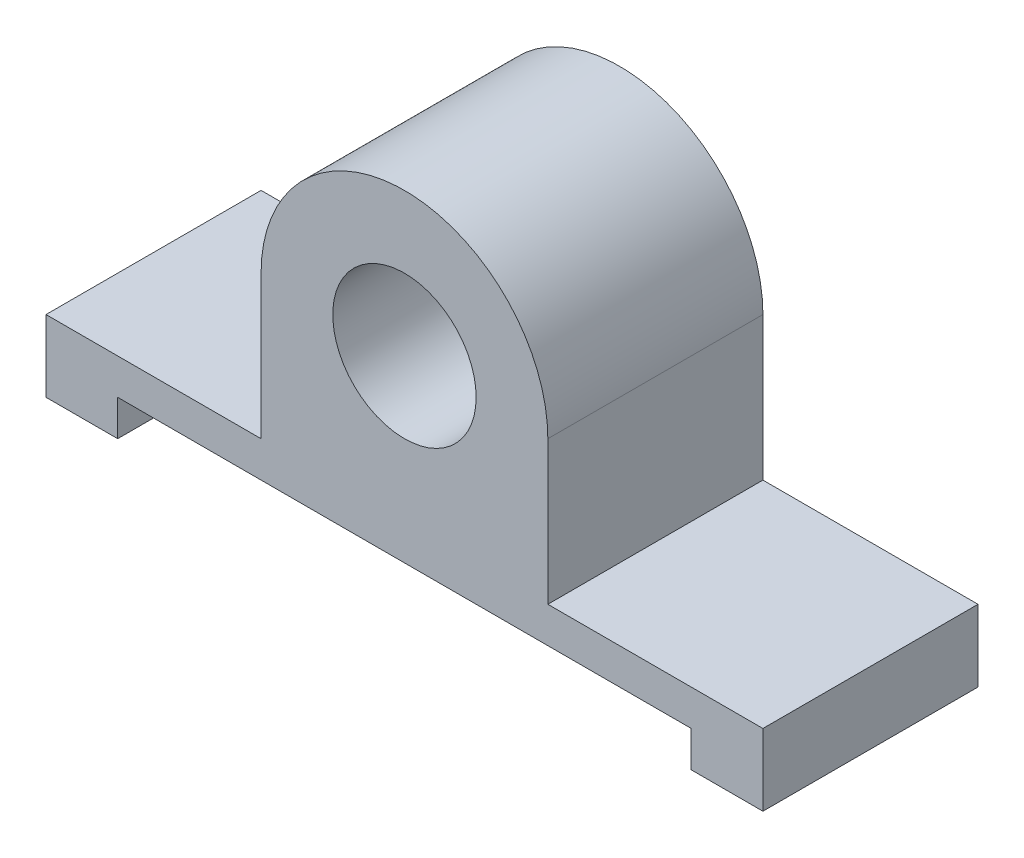
ISO-10303-21;
HEADER;
FILE_DESCRIPTION(('STEP AP214'),'2;1');
FILE_NAME('part.step','',(''),(''),'','','');
FILE_SCHEMA(('AUTOMOTIVE_DESIGN { 1 0 10303 214 1 1 1 1 }'));
ENDSEC;
DATA;
#1=APPLICATION_CONTEXT('core data for automotive mechanical design processes');
#2=APPLICATION_PROTOCOL_DEFINITION('international standard','automotive_design',2000,#1);
#3=PRODUCT_CONTEXT('',#1,'mechanical');
#4=PRODUCT('Part','Part','',(#3));
#5=PRODUCT_RELATED_PRODUCT_CATEGORY('part','',(#4));
#6=PRODUCT_DEFINITION_FORMATION('','',#4);
#7=PRODUCT_DEFINITION_CONTEXT('part definition',#1,'design');
#8=PRODUCT_DEFINITION('design','',#6,#7);
#9=PRODUCT_DEFINITION_SHAPE('','',#8);
#10=(LENGTH_UNIT() NAMED_UNIT(*) SI_UNIT(.MILLI.,.METRE.));
#11=(NAMED_UNIT(*) PLANE_ANGLE_UNIT() SI_UNIT($,.RADIAN.));
#12=(NAMED_UNIT(*) SI_UNIT($,.STERADIAN.) SOLID_ANGLE_UNIT());
#13=UNCERTAINTY_MEASURE_WITH_UNIT(LENGTH_MEASURE(1.E-05),#10,'distance_accuracy_value','');
#14=(GEOMETRIC_REPRESENTATION_CONTEXT(3) GLOBAL_UNCERTAINTY_ASSIGNED_CONTEXT((#13)) GLOBAL_UNIT_ASSIGNED_CONTEXT((#10,
#11,#12)) REPRESENTATION_CONTEXT('',''));
#15=CARTESIAN_POINT('',(0.,0.,0.));
#16=DIRECTION('',(0.,0.,1.));
#17=DIRECTION('',(1.,0.,0.));
#18=AXIS2_PLACEMENT_3D('',#15,#16,#17);
#19=CARTESIAN_POINT('',(1.87479352849255,4.24428591296876,30.));
#20=DIRECTION('',(0.,0.,1.));
#21=DIRECTION('',(1.,0.,0.));
#22=AXIS2_PLACEMENT_3D('',#19,#20,#21);
#23=PLANE('',#22);
#24=DIRECTION('',(0.,-1.,0.));
#25=VECTOR('',#24,1.);
#26=CARTESIAN_POINT('',(41.8747935284925,-20.7557140870312,30.));
#27=LINE('',#26,#25);
#28=CARTESIAN_POINT('',(41.8747935284925,-20.7557140870312,30.));
#29=VERTEX_POINT('',#28);
#30=CARTESIAN_POINT('',(41.8747935284925,-25.7557140870312,30.));
#31=VERTEX_POINT('',#30);
#32=EDGE_CURVE('E177',#29,#31,#27,.T.);
#33=ORIENTED_EDGE('',*,*,#32,.T.);
#34=DIRECTION('',(1.,0.,0.));
#35=VECTOR('',#34,1.);
#36=CARTESIAN_POINT('',(41.8747935284925,-25.7557140870312,30.));
#37=LINE('',#36,#35);
#38=CARTESIAN_POINT('',(51.8747935284926,-25.7557140870312,30.));
#39=VERTEX_POINT('',#38);
#40=EDGE_CURVE('E105',#31,#39,#37,.T.);
#41=ORIENTED_EDGE('',*,*,#40,.T.);
#42=DIRECTION('',(0.,1.,0.));
#43=VECTOR('',#42,1.);
#44=CARTESIAN_POINT('',(51.8747935284926,-25.7557140870312,30.));
#45=LINE('',#44,#43);
#46=CARTESIAN_POINT('',(51.8747935284926,-15.7557140870312,30.));
#47=VERTEX_POINT('',#46);
#48=EDGE_CURVE('E204',#39,#47,#45,.T.);
#49=ORIENTED_EDGE('',*,*,#48,.T.);
#50=DIRECTION('',(-1.,0.,0.));
#51=VECTOR('',#50,1.);
#52=CARTESIAN_POINT('',(51.8747935284926,-15.7557140870312,30.));
#53=LINE('',#52,#51);
#54=CARTESIAN_POINT('',(21.8747935284926,-15.7557140870312,30.));
#55=VERTEX_POINT('',#54);
#56=EDGE_CURVE('E223',#47,#55,#53,.T.);
#57=ORIENTED_EDGE('',*,*,#56,.T.);
#58=DIRECTION('',(0.,1.,0.));
#59=VECTOR('',#58,1.);
#60=CARTESIAN_POINT('',(21.8747935284926,4.24428591296876,30.));
#61=LINE('',#60,#59);
#62=CARTESIAN_POINT('',(21.8747935284926,4.24428591296876,30.));
#63=VERTEX_POINT('',#62);
#64=EDGE_CURVE('E220',#55,#63,#61,.T.);
#65=ORIENTED_EDGE('',*,*,#64,.T.);
#66=CARTESIAN_POINT('',(1.87479352849255,4.24428591296876,30.));
#67=DIRECTION('',(0.,0.,1.));
#68=DIRECTION('',(1.,0.,0.));
#69=AXIS2_PLACEMENT_3D('',#66,#67,#68);
#70=CIRCLE('',#69,20.);
#71=CARTESIAN_POINT('',(-18.1252064715075,4.24428591296875,30.));
#72=VERTEX_POINT('',#71);
#73=EDGE_CURVE('E222',#63,#72,#70,.T.);
#74=ORIENTED_EDGE('',*,*,#73,.T.);
#75=DIRECTION('',(0.,-1.,0.));
#76=VECTOR('',#75,1.);
#77=CARTESIAN_POINT('',(-18.1252064715075,4.24428591296875,30.));
#78=LINE('',#77,#76);
#79=CARTESIAN_POINT('',(-18.1252064715074,-15.7557140870312,30.));
#80=VERTEX_POINT('',#79);
#81=EDGE_CURVE('E225',#72,#80,#78,.T.);
#82=ORIENTED_EDGE('',*,*,#81,.T.);
#83=DIRECTION('',(-1.,0.,0.));
#84=VECTOR('',#83,1.);
#85=CARTESIAN_POINT('',(-48.1252064715074,-15.7557140870313,30.));
#86=LINE('',#85,#84);
#87=CARTESIAN_POINT('',(-48.1252064715074,-15.7557140870313,30.));
#88=VERTEX_POINT('',#87);
#89=EDGE_CURVE('E231',#80,#88,#86,.T.);
#90=ORIENTED_EDGE('',*,*,#89,.T.);
#91=DIRECTION('',(0.,-1.,0.));
#92=VECTOR('',#91,1.);
#93=CARTESIAN_POINT('',(-48.1252064715074,-25.7557140870313,30.));
#94=LINE('',#93,#92);
#95=CARTESIAN_POINT('',(-48.1252064715074,-25.7557140870313,30.));
#96=VERTEX_POINT('',#95);
#97=EDGE_CURVE('E136',#88,#96,#94,.T.);
#98=ORIENTED_EDGE('',*,*,#97,.T.);
#99=DIRECTION('',(1.,0.,0.));
#100=VECTOR('',#99,1.);
#101=CARTESIAN_POINT('',(-38.1252064715074,-25.7557140870312,30.));
#102=LINE('',#101,#100);
#103=CARTESIAN_POINT('',(-38.1252064715074,-25.7557140870312,30.));
#104=VERTEX_POINT('',#103);
#105=EDGE_CURVE('E130',#96,#104,#102,.T.);
#106=ORIENTED_EDGE('',*,*,#105,.T.);
#107=DIRECTION('',(0.,1.,0.));
#108=VECTOR('',#107,1.);
#109=CARTESIAN_POINT('',(-38.1252064715074,-20.7557140870312,30.));
#110=LINE('',#109,#108);
#111=CARTESIAN_POINT('',(-38.1252064715074,-20.7557140870312,30.));
#112=VERTEX_POINT('',#111);
#113=EDGE_CURVE('E134',#104,#112,#110,.T.);
#114=ORIENTED_EDGE('',*,*,#113,.T.);
#115=DIRECTION('',(1.,0.,0.));
#116=VECTOR('',#115,1.);
#117=CARTESIAN_POINT('',(-38.1252064715074,-20.7557140870312,30.));
#118=LINE('',#117,#116);
#119=EDGE_CURVE('E50',#112,#29,#118,.T.);
#120=ORIENTED_EDGE('',*,*,#119,.T.);
#121=EDGE_LOOP('',(#33,#41,#49,#57,#65,#74,#82,#90,#98,#106,#114,#120));
#122=FACE_BOUND('',#121,.T.);
#123=CARTESIAN_POINT('',(1.87479352849255,4.24428591296876,30.));
#124=DIRECTION('',(0.,0.,1.));
#125=DIRECTION('',(1.,0.,0.));
#126=AXIS2_PLACEMENT_3D('',#123,#124,#125);
#127=CIRCLE('',#126,10.);
#128=CARTESIAN_POINT('',(11.8747935284926,4.24428591296876,30.));
#129=VERTEX_POINT('',#128);
#130=EDGE_CURVE('E158',#129,#129,#127,.T.);
#131=ORIENTED_EDGE('',*,*,#130,.F.);
#132=EDGE_LOOP('',(#131));
#133=FACE_BOUND('',#132,.T.);
#134=ADVANCED_FACE('F33',(#122,#133),#23,.T.);
#135=CARTESIAN_POINT('',(1.87479352849255,4.24428591296876,0.));
#136=DIRECTION('',(0.,0.,1.));
#137=DIRECTION('',(1.,0.,0.));
#138=AXIS2_PLACEMENT_3D('',#135,#136,#137);
#139=PLANE('',#138);
#140=DIRECTION('',(0.,-1.,0.));
#141=VECTOR('',#140,1.);
#142=CARTESIAN_POINT('',(41.8747935284925,-20.7557140870312,0.));
#143=LINE('',#142,#141);
#144=CARTESIAN_POINT('',(41.8747935284925,-20.7557140870312,0.));
#145=VERTEX_POINT('',#144);
#146=CARTESIAN_POINT('',(41.8747935284925,-25.7557140870312,0.));
#147=VERTEX_POINT('',#146);
#148=EDGE_CURVE('E154',#145,#147,#143,.T.);
#149=ORIENTED_EDGE('',*,*,#148,.F.);
#150=DIRECTION('',(1.,0.,0.));
#151=VECTOR('',#150,1.);
#152=CARTESIAN_POINT('',(-38.1252064715074,-20.7557140870312,0.));
#153=LINE('',#152,#151);
#154=CARTESIAN_POINT('',(-38.1252064715074,-20.7557140870312,0.));
#155=VERTEX_POINT('',#154);
#156=EDGE_CURVE('E97',#155,#145,#153,.T.);
#157=ORIENTED_EDGE('',*,*,#156,.F.);
#158=DIRECTION('',(0.,1.,0.));
#159=VECTOR('',#158,1.);
#160=CARTESIAN_POINT('',(-38.1252064715074,-20.7557140870312,0.));
#161=LINE('',#160,#159);
#162=CARTESIAN_POINT('',(-38.1252064715074,-25.7557140870312,0.));
#163=VERTEX_POINT('',#162);
#164=EDGE_CURVE('E91',#163,#155,#161,.T.);
#165=ORIENTED_EDGE('',*,*,#164,.F.);
#166=DIRECTION('',(1.,0.,0.));
#167=VECTOR('',#166,1.);
#168=CARTESIAN_POINT('',(-38.1252064715074,-25.7557140870312,0.));
#169=LINE('',#168,#167);
#170=CARTESIAN_POINT('',(-48.1252064715074,-25.7557140870313,0.));
#171=VERTEX_POINT('',#170);
#172=EDGE_CURVE('E144',#171,#163,#169,.T.);
#173=ORIENTED_EDGE('',*,*,#172,.F.);
#174=DIRECTION('',(0.,-1.,0.));
#175=VECTOR('',#174,1.);
#176=CARTESIAN_POINT('',(-48.1252064715074,-25.7557140870313,0.));
#177=LINE('',#176,#175);
#178=CARTESIAN_POINT('',(-48.1252064715074,-15.7557140870313,0.));
#179=VERTEX_POINT('',#178);
#180=EDGE_CURVE('E172',#179,#171,#177,.T.);
#181=ORIENTED_EDGE('',*,*,#180,.F.);
#182=DIRECTION('',(-1.,0.,0.));
#183=VECTOR('',#182,1.);
#184=CARTESIAN_POINT('',(-48.1252064715074,-15.7557140870313,0.));
#185=LINE('',#184,#183);
#186=CARTESIAN_POINT('',(-18.1252064715074,-15.7557140870312,0.));
#187=VERTEX_POINT('',#186);
#188=EDGE_CURVE('E170',#187,#179,#185,.T.);
#189=ORIENTED_EDGE('',*,*,#188,.F.);
#190=DIRECTION('',(0.,-1.,0.));
#191=VECTOR('',#190,1.);
#192=CARTESIAN_POINT('',(-18.1252064715075,4.24428591296875,0.));
#193=LINE('',#192,#191);
#194=CARTESIAN_POINT('',(-18.1252064715075,4.24428591296875,0.));
#195=VERTEX_POINT('',#194);
#196=EDGE_CURVE('E168',#195,#187,#193,.T.);
#197=ORIENTED_EDGE('',*,*,#196,.F.);
#198=CARTESIAN_POINT('',(1.87479352849255,4.24428591296876,0.));
#199=DIRECTION('',(0.,0.,1.));
#200=DIRECTION('',(1.,0.,0.));
#201=AXIS2_PLACEMENT_3D('',#198,#199,#200);
#202=CIRCLE('',#201,20.);
#203=CARTESIAN_POINT('',(21.8747935284926,4.24428591296876,0.));
#204=VERTEX_POINT('',#203);
#205=EDGE_CURVE('E166',#204,#195,#202,.T.);
#206=ORIENTED_EDGE('',*,*,#205,.F.);
#207=DIRECTION('',(0.,1.,0.));
#208=VECTOR('',#207,1.);
#209=CARTESIAN_POINT('',(21.8747935284926,4.24428591296876,0.));
#210=LINE('',#209,#208);
#211=CARTESIAN_POINT('',(21.8747935284926,-15.7557140870312,0.));
#212=VERTEX_POINT('',#211);
#213=EDGE_CURVE('E164',#212,#204,#210,.T.);
#214=ORIENTED_EDGE('',*,*,#213,.F.);
#215=DIRECTION('',(-1.,0.,0.));
#216=VECTOR('',#215,1.);
#217=CARTESIAN_POINT('',(51.8747935284926,-15.7557140870312,0.));
#218=LINE('',#217,#216);
#219=CARTESIAN_POINT('',(51.8747935284926,-15.7557140870312,0.));
#220=VERTEX_POINT('',#219);
#221=EDGE_CURVE('E162',#220,#212,#218,.T.);
#222=ORIENTED_EDGE('',*,*,#221,.F.);
#223=DIRECTION('',(0.,1.,0.));
#224=VECTOR('',#223,1.);
#225=CARTESIAN_POINT('',(51.8747935284926,-25.7557140870312,0.));
#226=LINE('',#225,#224);
#227=CARTESIAN_POINT('',(51.8747935284926,-25.7557140870312,0.));
#228=VERTEX_POINT('',#227);
#229=EDGE_CURVE('E160',#228,#220,#226,.T.);
#230=ORIENTED_EDGE('',*,*,#229,.F.);
#231=DIRECTION('',(1.,0.,0.));
#232=VECTOR('',#231,1.);
#233=CARTESIAN_POINT('',(41.8747935284925,-25.7557140870312,0.));
#234=LINE('',#233,#232);
#235=EDGE_CURVE('E157',#147,#228,#234,.T.);
#236=ORIENTED_EDGE('',*,*,#235,.F.);
#237=EDGE_LOOP('',(#149,#157,#165,#173,#181,#189,#197,#206,#214,#222,#230,#236));
#238=FACE_BOUND('',#237,.T.);
#239=CARTESIAN_POINT('',(1.87479352849255,4.24428591296876,0.));
#240=DIRECTION('',(0.,0.,1.));
#241=DIRECTION('',(1.,0.,0.));
#242=AXIS2_PLACEMENT_3D('',#239,#240,#241);
#243=CIRCLE('',#242,10.);
#244=CARTESIAN_POINT('',(11.8747935284926,4.24428591296876,0.));
#245=VERTEX_POINT('',#244);
#246=EDGE_CURVE('E378',#245,#245,#243,.T.);
#247=ORIENTED_EDGE('',*,*,#246,.T.);
#248=EDGE_LOOP('',(#247));
#249=FACE_BOUND('',#248,.T.);
#250=ADVANCED_FACE('F208',(#238,#249),#139,.F.);
#251=CARTESIAN_POINT('',(41.8747935284925,-20.7557140870312,30.));
#252=DIRECTION('',(1.,0.,0.));
#253=DIRECTION('',(0.,0.,-1.));
#254=AXIS2_PLACEMENT_3D('',#251,#252,#253);
#255=PLANE('',#254);
#256=ORIENTED_EDGE('',*,*,#148,.T.);
#257=DIRECTION('',(0.,0.,-1.));
#258=VECTOR('',#257,1.);
#259=CARTESIAN_POINT('',(41.8747935284925,-25.7557140870312,30.));
#260=LINE('',#259,#258);
#261=EDGE_CURVE('E11',#31,#147,#260,.T.);
#262=ORIENTED_EDGE('',*,*,#261,.F.);
#263=ORIENTED_EDGE('',*,*,#32,.F.);
#264=DIRECTION('',(0.,0.,-1.));
#265=VECTOR('',#264,1.);
#266=CARTESIAN_POINT('',(41.8747935284925,-20.7557140870312,30.));
#267=LINE('',#266,#265);
#268=EDGE_CURVE('E150',#29,#145,#267,.T.);
#269=ORIENTED_EDGE('',*,*,#268,.T.);
#270=EDGE_LOOP('',(#256,#262,#263,#269));
#271=FACE_BOUND('',#270,.T.);
#272=ADVANCED_FACE('F35',(#271),#255,.F.);
#273=CARTESIAN_POINT('',(41.8747935284925,-25.7557140870312,30.));
#274=DIRECTION('',(0.,1.,0.));
#275=DIRECTION('',(-1.,0.,0.));
#276=AXIS2_PLACEMENT_3D('',#273,#274,#275);
#277=PLANE('',#276);
#278=ORIENTED_EDGE('',*,*,#235,.T.);
#279=DIRECTION('',(0.,0.,-1.));
#280=VECTOR('',#279,1.);
#281=CARTESIAN_POINT('',(51.8747935284926,-25.7557140870312,30.));
#282=LINE('',#281,#280);
#283=EDGE_CURVE('E42',#39,#228,#282,.T.);
#284=ORIENTED_EDGE('',*,*,#283,.F.);
#285=ORIENTED_EDGE('',*,*,#40,.F.);
#286=ORIENTED_EDGE('',*,*,#261,.T.);
#287=EDGE_LOOP('',(#278,#284,#285,#286));
#288=FACE_BOUND('',#287,.T.);
#289=ADVANCED_FACE('F265',(#288),#277,.F.);
#290=CARTESIAN_POINT('',(51.8747935284926,-25.7557140870312,30.));
#291=DIRECTION('',(-1.,0.,0.));
#292=DIRECTION('',(0.,0.,1.));
#293=AXIS2_PLACEMENT_3D('',#290,#291,#292);
#294=PLANE('',#293);
#295=ORIENTED_EDGE('',*,*,#229,.T.);
#296=DIRECTION('',(0.,0.,-1.));
#297=VECTOR('',#296,1.);
#298=CARTESIAN_POINT('',(51.8747935284926,-15.7557140870312,30.));
#299=LINE('',#298,#297);
#300=EDGE_CURVE('E196',#47,#220,#299,.T.);
#301=ORIENTED_EDGE('',*,*,#300,.F.);
#302=ORIENTED_EDGE('',*,*,#48,.F.);
#303=ORIENTED_EDGE('',*,*,#283,.T.);
#304=EDGE_LOOP('',(#295,#301,#302,#303));
#305=FACE_BOUND('',#304,.T.);
#306=ADVANCED_FACE('F202',(#305),#294,.F.);
#307=CARTESIAN_POINT('',(51.8747935284926,-15.7557140870312,30.));
#308=DIRECTION('',(0.,-1.,0.));
#309=DIRECTION('',(1.,0.,0.));
#310=AXIS2_PLACEMENT_3D('',#307,#308,#309);
#311=PLANE('',#310);
#312=ORIENTED_EDGE('',*,*,#221,.T.);
#313=DIRECTION('',(0.,0.,-1.));
#314=VECTOR('',#313,1.);
#315=CARTESIAN_POINT('',(21.8747935284926,-15.7557140870312,30.));
#316=LINE('',#315,#314);
#317=EDGE_CURVE('E193',#55,#212,#316,.T.);
#318=ORIENTED_EDGE('',*,*,#317,.F.);
#319=ORIENTED_EDGE('',*,*,#56,.F.);
#320=ORIENTED_EDGE('',*,*,#300,.T.);
#321=EDGE_LOOP('',(#312,#318,#319,#320));
#322=FACE_BOUND('',#321,.T.);
#323=ADVANCED_FACE('F214',(#322),#311,.F.);
#324=CARTESIAN_POINT('',(21.8747935284926,4.24428591296876,30.));
#325=DIRECTION('',(-1.,0.,0.));
#326=DIRECTION('',(0.,0.,1.));
#327=AXIS2_PLACEMENT_3D('',#324,#325,#326);
#328=PLANE('',#327);
#329=ORIENTED_EDGE('',*,*,#213,.T.);
#330=DIRECTION('',(0.,0.,-1.));
#331=VECTOR('',#330,1.);
#332=CARTESIAN_POINT('',(21.8747935284926,4.24428591296876,30.));
#333=LINE('',#332,#331);
#334=EDGE_CURVE('E190',#63,#204,#333,.T.);
#335=ORIENTED_EDGE('',*,*,#334,.F.);
#336=ORIENTED_EDGE('',*,*,#64,.F.);
#337=ORIENTED_EDGE('',*,*,#317,.T.);
#338=EDGE_LOOP('',(#329,#335,#336,#337));
#339=FACE_BOUND('',#338,.T.);
#340=ADVANCED_FACE('F218',(#339),#328,.F.);
#341=CARTESIAN_POINT('',(1.87479352849255,4.24428591296876,30.));
#342=DIRECTION('',(0.,0.,-1.));
#343=DIRECTION('',(-1.,0.,0.));
#344=AXIS2_PLACEMENT_3D('',#341,#342,#343);
#345=CYLINDRICAL_SURFACE('',#344,20.);
#346=ORIENTED_EDGE('',*,*,#205,.T.);
#347=DIRECTION('',(0.,0.,-1.));
#348=VECTOR('',#347,1.);
#349=CARTESIAN_POINT('',(-18.1252064715075,4.24428591296875,30.));
#350=LINE('',#349,#348);
#351=EDGE_CURVE('E187',#72,#195,#350,.T.);
#352=ORIENTED_EDGE('',*,*,#351,.F.);
#353=ORIENTED_EDGE('',*,*,#73,.F.);
#354=ORIENTED_EDGE('',*,*,#334,.T.);
#355=EDGE_LOOP('',(#346,#352,#353,#354));
#356=FACE_BOUND('',#355,.T.);
#357=ADVANCED_FACE('F278',(#356),#345,.T.);
#358=CARTESIAN_POINT('',(-18.1252064715075,4.24428591296875,30.));
#359=DIRECTION('',(1.,0.,0.));
#360=DIRECTION('',(0.,1.,0.));
#361=AXIS2_PLACEMENT_3D('',#358,#359,#360);
#362=PLANE('',#361);
#363=ORIENTED_EDGE('',*,*,#196,.T.);
#364=DIRECTION('',(0.,0.,-1.));
#365=VECTOR('',#364,1.);
#366=CARTESIAN_POINT('',(-18.1252064715074,-15.7557140870312,30.));
#367=LINE('',#366,#365);
#368=EDGE_CURVE('E184',#80,#187,#367,.T.);
#369=ORIENTED_EDGE('',*,*,#368,.F.);
#370=ORIENTED_EDGE('',*,*,#81,.F.);
#371=ORIENTED_EDGE('',*,*,#351,.T.);
#372=EDGE_LOOP('',(#363,#369,#370,#371));
#373=FACE_BOUND('',#372,.T.);
#374=ADVANCED_FACE('F281',(#373),#362,.F.);
#375=CARTESIAN_POINT('',(-48.1252064715074,-15.7557140870313,30.));
#376=DIRECTION('',(0.,-1.,0.));
#377=DIRECTION('',(1.,0.,0.));
#378=AXIS2_PLACEMENT_3D('',#375,#376,#377);
#379=PLANE('',#378);
#380=ORIENTED_EDGE('',*,*,#188,.T.);
#381=DIRECTION('',(0.,0.,-1.));
#382=VECTOR('',#381,1.);
#383=CARTESIAN_POINT('',(-48.1252064715074,-15.7557140870313,30.));
#384=LINE('',#383,#382);
#385=EDGE_CURVE('E181',#88,#179,#384,.T.);
#386=ORIENTED_EDGE('',*,*,#385,.F.);
#387=ORIENTED_EDGE('',*,*,#89,.F.);
#388=ORIENTED_EDGE('',*,*,#368,.T.);
#389=EDGE_LOOP('',(#380,#386,#387,#388));
#390=FACE_BOUND('',#389,.T.);
#391=ADVANCED_FACE('F237',(#390),#379,.F.);
#392=CARTESIAN_POINT('',(-48.1252064715074,-25.7557140870313,30.));
#393=DIRECTION('',(1.,0.,0.));
#394=DIRECTION('',(0.,0.,-1.));
#395=AXIS2_PLACEMENT_3D('',#392,#393,#394);
#396=PLANE('',#395);
#397=ORIENTED_EDGE('',*,*,#180,.T.);
#398=DIRECTION('',(0.,0.,-1.));
#399=VECTOR('',#398,1.);
#400=CARTESIAN_POINT('',(-48.1252064715074,-25.7557140870313,30.));
#401=LINE('',#400,#399);
#402=EDGE_CURVE('E145',#96,#171,#401,.T.);
#403=ORIENTED_EDGE('',*,*,#402,.F.);
#404=ORIENTED_EDGE('',*,*,#97,.F.);
#405=ORIENTED_EDGE('',*,*,#385,.T.);
#406=EDGE_LOOP('',(#397,#403,#404,#405));
#407=FACE_BOUND('',#406,.T.);
#408=ADVANCED_FACE('F241',(#407),#396,.F.);
#409=CARTESIAN_POINT('',(-38.1252064715074,-25.7557140870312,30.));
#410=DIRECTION('',(0.,1.,0.));
#411=DIRECTION('',(-1.,0.,0.));
#412=AXIS2_PLACEMENT_3D('',#409,#410,#411);
#413=PLANE('',#412);
#414=ORIENTED_EDGE('',*,*,#172,.T.);
#415=DIRECTION('',(0.,0.,-1.));
#416=VECTOR('',#415,1.);
#417=CARTESIAN_POINT('',(-38.1252064715074,-25.7557140870312,30.));
#418=LINE('',#417,#416);
#419=EDGE_CURVE('E141',#104,#163,#418,.T.);
#420=ORIENTED_EDGE('',*,*,#419,.F.);
#421=ORIENTED_EDGE('',*,*,#105,.F.);
#422=ORIENTED_EDGE('',*,*,#402,.T.);
#423=EDGE_LOOP('',(#414,#420,#421,#422));
#424=FACE_BOUND('',#423,.T.);
#425=ADVANCED_FACE('F142',(#424),#413,.F.);
#426=CARTESIAN_POINT('',(-38.1252064715074,-20.7557140870312,30.));
#427=DIRECTION('',(-1.,0.,0.));
#428=DIRECTION('',(0.,0.,1.));
#429=AXIS2_PLACEMENT_3D('',#426,#427,#428);
#430=PLANE('',#429);
#431=ORIENTED_EDGE('',*,*,#164,.T.);
#432=DIRECTION('',(0.,0.,-1.));
#433=VECTOR('',#432,1.);
#434=CARTESIAN_POINT('',(-38.1252064715074,-20.7557140870312,30.));
#435=LINE('',#434,#433);
#436=EDGE_CURVE('E146',#112,#155,#435,.T.);
#437=ORIENTED_EDGE('',*,*,#436,.F.);
#438=ORIENTED_EDGE('',*,*,#113,.F.);
#439=ORIENTED_EDGE('',*,*,#419,.T.);
#440=EDGE_LOOP('',(#431,#437,#438,#439));
#441=FACE_BOUND('',#440,.T.);
#442=ADVANCED_FACE('F148',(#441),#430,.F.);
#443=CARTESIAN_POINT('',(-38.1252064715074,-20.7557140870312,30.));
#444=DIRECTION('',(0.,1.,0.));
#445=DIRECTION('',(-1.,0.,0.));
#446=AXIS2_PLACEMENT_3D('',#443,#444,#445);
#447=PLANE('',#446);
#448=ORIENTED_EDGE('',*,*,#156,.T.);
#449=ORIENTED_EDGE('',*,*,#268,.F.);
#450=ORIENTED_EDGE('',*,*,#119,.F.);
#451=ORIENTED_EDGE('',*,*,#436,.T.);
#452=EDGE_LOOP('',(#448,#449,#450,#451));
#453=FACE_BOUND('',#452,.T.);
#454=ADVANCED_FACE('F245',(#453),#447,.F.);
#455=CARTESIAN_POINT('',(1.87479352849255,4.24428591296876,30.));
#456=DIRECTION('',(0.,0.,-1.));
#457=DIRECTION('',(-1.,0.,0.));
#458=AXIS2_PLACEMENT_3D('',#455,#456,#457);
#459=CYLINDRICAL_SURFACE('',#458,10.);
#460=ORIENTED_EDGE('',*,*,#130,.T.);
#461=EDGE_LOOP('',(#460));
#462=FACE_BOUND('',#461,.T.);
#463=ORIENTED_EDGE('',*,*,#246,.F.);
#464=EDGE_LOOP('',(#463));
#465=FACE_BOUND('',#464,.T.);
#466=ADVANCED_FACE('F247',(#462,#465),#459,.F.);
#467=CLOSED_SHELL('',(#134,#250,#272,#289,#306,#323,#340,#357,#374,#391,#408,#425,#442,#454,#466));
#468=MANIFOLD_SOLID_BREP('B2',#467);
#469=ADVANCED_BREP_SHAPE_REPRESENTATION('',(#18,#468),#14);
#470=SHAPE_DEFINITION_REPRESENTATION(#9,#469);
ENDSEC;
END-ISO-10303-21;
